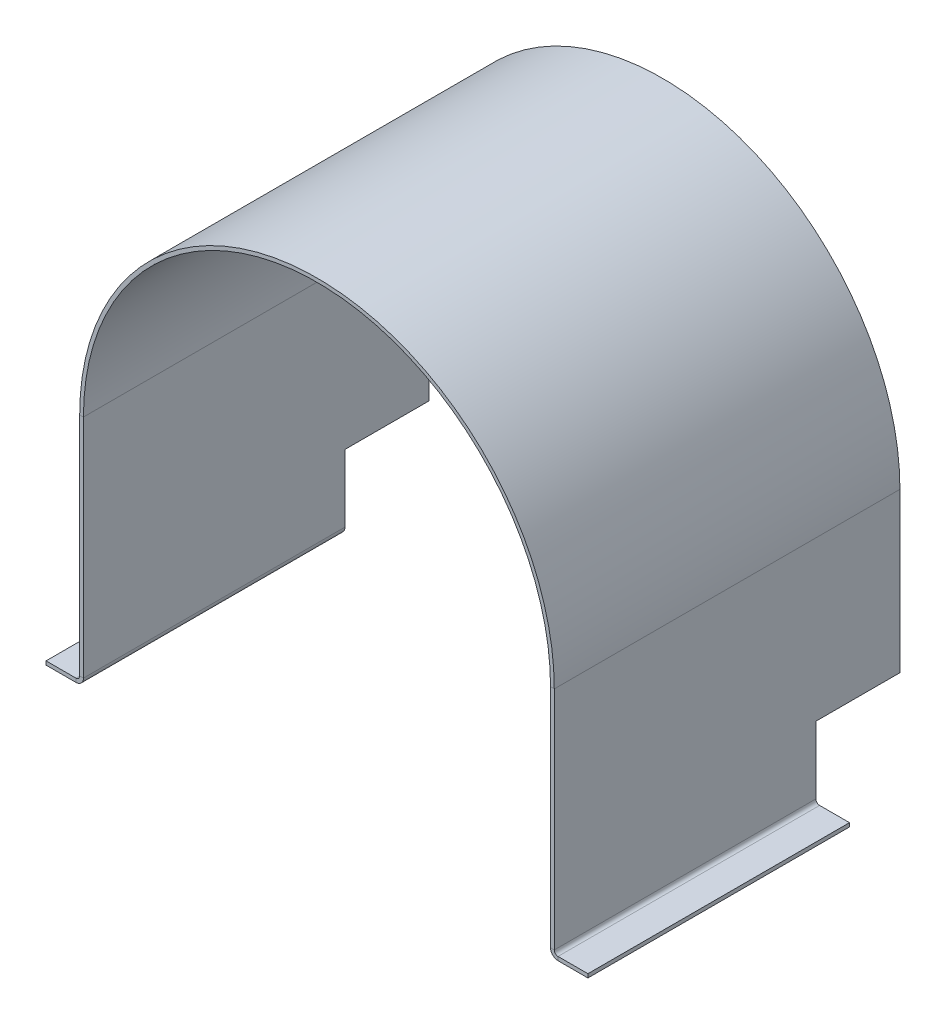
ISO-10303-21;
HEADER;
FILE_DESCRIPTION(('STEP AP214'),'2;1');
FILE_NAME('part.step','',(''),(''),'','','');
FILE_SCHEMA(('AUTOMOTIVE_DESIGN { 1 0 10303 214 1 1 1 1 }'));
ENDSEC;
DATA;
#1=APPLICATION_CONTEXT('core data for automotive mechanical design processes');
#2=APPLICATION_PROTOCOL_DEFINITION('international standard','automotive_design',2000,#1);
#3=PRODUCT_CONTEXT('',#1,'mechanical');
#4=PRODUCT('Part','Part','',(#3));
#5=PRODUCT_RELATED_PRODUCT_CATEGORY('part','',(#4));
#6=PRODUCT_DEFINITION_FORMATION('','',#4);
#7=PRODUCT_DEFINITION_CONTEXT('part definition',#1,'design');
#8=PRODUCT_DEFINITION('design','',#6,#7);
#9=PRODUCT_DEFINITION_SHAPE('','',#8);
#10=(LENGTH_UNIT() NAMED_UNIT(*) SI_UNIT(.MILLI.,.METRE.));
#11=(NAMED_UNIT(*) PLANE_ANGLE_UNIT() SI_UNIT($,.RADIAN.));
#12=(NAMED_UNIT(*) SI_UNIT($,.STERADIAN.) SOLID_ANGLE_UNIT());
#13=UNCERTAINTY_MEASURE_WITH_UNIT(LENGTH_MEASURE(1.E-05),#10,'distance_accuracy_value','');
#14=(GEOMETRIC_REPRESENTATION_CONTEXT(3) GLOBAL_UNCERTAINTY_ASSIGNED_CONTEXT((#13)) GLOBAL_UNIT_ASSIGNED_CONTEXT((#10,
#11,#12)) REPRESENTATION_CONTEXT('',''));
#15=CARTESIAN_POINT('',(0.,0.,0.));
#16=DIRECTION('',(0.,0.,1.));
#17=DIRECTION('',(1.,0.,0.));
#18=AXIS2_PLACEMENT_3D('',#15,#16,#17);
#19=CARTESIAN_POINT('',(-145.,-125.,45.));
#20=DIRECTION('',(0.,0.,1.));
#21=DIRECTION('',(1.,0.,0.));
#22=AXIS2_PLACEMENT_3D('',#19,#20,#21);
#23=PLANE('',#22);
#24=DIRECTION('',(1.,0.,0.));
#25=VECTOR('',#24,1.);
#26=CARTESIAN_POINT('',(-125.,-123.,45.));
#27=LINE('',#26,#25);
#28=CARTESIAN_POINT('',(-145.,-123.,45.));
#29=VERTEX_POINT('',#28);
#30=CARTESIAN_POINT('',(-129.,-123.,45.));
#31=VERTEX_POINT('',#30);
#32=EDGE_CURVE('E252',#29,#31,#27,.T.);
#33=ORIENTED_EDGE('',*,*,#32,.T.);
#34=DIRECTION('',(0.,-1.,0.));
#35=VECTOR('',#34,1.);
#36=CARTESIAN_POINT('',(-129.,-123.,45.));
#37=LINE('',#36,#35);
#38=CARTESIAN_POINT('',(-129.,-125.,45.));
#39=VERTEX_POINT('',#38);
#40=EDGE_CURVE('E11',#31,#39,#37,.T.);
#41=ORIENTED_EDGE('',*,*,#40,.T.);
#42=DIRECTION('',(1.,0.,0.));
#43=VECTOR('',#42,1.);
#44=CARTESIAN_POINT('',(-145.,-125.,45.));
#45=LINE('',#44,#43);
#46=CARTESIAN_POINT('',(-145.,-125.,45.));
#47=VERTEX_POINT('',#46);
#48=EDGE_CURVE('E195',#47,#39,#45,.T.);
#49=ORIENTED_EDGE('',*,*,#48,.F.);
#50=DIRECTION('',(0.,-1.,0.));
#51=VECTOR('',#50,1.);
#52=CARTESIAN_POINT('',(-145.,-125.,45.));
#53=LINE('',#52,#51);
#54=EDGE_CURVE('E184',#29,#47,#53,.T.);
#55=ORIENTED_EDGE('',*,*,#54,.F.);
#56=EDGE_LOOP('',(#33,#41,#49,#55));
#57=FACE_BOUND('',#56,.T.);
#58=ADVANCED_FACE('F38',(#57),#23,.F.);
#59=DIRECTION('',(0.,1.,0.));
#60=VECTOR('',#59,1.);
#61=CARTESIAN_POINT('',(-125.,0.,45.));
#62=LINE('',#61,#60);
#63=CARTESIAN_POINT('',(-125.,-121.,45.));
#64=VERTEX_POINT('',#63);
#65=CARTESIAN_POINT('',(-125.,-84.9999999999999,45.));
#66=VERTEX_POINT('',#65);
#67=EDGE_CURVE('E240',#64,#66,#62,.T.);
#68=ORIENTED_EDGE('',*,*,#67,.F.);
#69=DIRECTION('',(-1.,0.,0.));
#70=VECTOR('',#69,1.);
#71=CARTESIAN_POINT('',(-125.,-121.,45.));
#72=LINE('',#71,#70);
#73=CARTESIAN_POINT('',(-127.,-121.,45.));
#74=VERTEX_POINT('',#73);
#75=EDGE_CURVE('E46',#64,#74,#72,.T.);
#76=ORIENTED_EDGE('',*,*,#75,.T.);
#77=DIRECTION('',(0.,1.,0.));
#78=VECTOR('',#77,1.);
#79=CARTESIAN_POINT('',(-127.,0.,45.));
#80=LINE('',#79,#78);
#81=CARTESIAN_POINT('',(-127.,-84.9999999999999,45.));
#82=VERTEX_POINT('',#81);
#83=EDGE_CURVE('E237',#74,#82,#80,.T.);
#84=ORIENTED_EDGE('',*,*,#83,.T.);
#85=DIRECTION('',(1.,0.,0.));
#86=VECTOR('',#85,1.);
#87=CARTESIAN_POINT('',(-145.,-84.9999999999999,45.));
#88=LINE('',#87,#86);
#89=EDGE_CURVE('E196',#82,#66,#88,.T.);
#90=ORIENTED_EDGE('',*,*,#89,.T.);
#91=EDGE_LOOP('',(#68,#76,#84,#90));
#92=FACE_BOUND('',#91,.T.);
#93=ADVANCED_FACE('F234',(#92),#23,.F.);
#94=DIRECTION('',(0.,-1.,0.));
#95=VECTOR('',#94,1.);
#96=CARTESIAN_POINT('',(127.,0.,45.));
#97=LINE('',#96,#95);
#98=CARTESIAN_POINT('',(127.,-85.,45.));
#99=VERTEX_POINT('',#98);
#100=CARTESIAN_POINT('',(127.,-121.,45.));
#101=VERTEX_POINT('',#100);
#102=EDGE_CURVE('E263',#99,#101,#97,.T.);
#103=ORIENTED_EDGE('',*,*,#102,.T.);
#104=DIRECTION('',(-1.,0.,0.));
#105=VECTOR('',#104,1.);
#106=CARTESIAN_POINT('',(127.,-121.,45.));
#107=LINE('',#106,#105);
#108=CARTESIAN_POINT('',(125.,-121.,45.));
#109=VERTEX_POINT('',#108);
#110=EDGE_CURVE('E230',#101,#109,#107,.T.);
#111=ORIENTED_EDGE('',*,*,#110,.T.);
#112=DIRECTION('',(0.,-1.,0.));
#113=VECTOR('',#112,1.);
#114=CARTESIAN_POINT('',(125.,0.,45.));
#115=LINE('',#114,#113);
#116=CARTESIAN_POINT('',(125.,-85.,45.));
#117=VERTEX_POINT('',#116);
#118=EDGE_CURVE('E435',#117,#109,#115,.T.);
#119=ORIENTED_EDGE('',*,*,#118,.F.);
#120=EDGE_CURVE('E426',#117,#99,#88,.T.);
#121=ORIENTED_EDGE('',*,*,#120,.T.);
#122=EDGE_LOOP('',(#103,#111,#119,#121));
#123=FACE_BOUND('',#122,.T.);
#124=ADVANCED_FACE('F433',(#123),#23,.F.);
#125=CARTESIAN_POINT('',(129.,-125.,45.));
#126=VERTEX_POINT('',#125);
#127=CARTESIAN_POINT('',(145.,-125.,45.));
#128=VERTEX_POINT('',#127);
#129=EDGE_CURVE('E177',#126,#128,#45,.T.);
#130=ORIENTED_EDGE('',*,*,#129,.F.);
#131=DIRECTION('',(0.,1.,0.));
#132=VECTOR('',#131,1.);
#133=CARTESIAN_POINT('',(129.,-125.,45.));
#134=LINE('',#133,#132);
#135=CARTESIAN_POINT('',(129.,-123.,45.));
#136=VERTEX_POINT('',#135);
#137=EDGE_CURVE('E61',#126,#136,#134,.T.);
#138=ORIENTED_EDGE('',*,*,#137,.T.);
#139=DIRECTION('',(1.,0.,0.));
#140=VECTOR('',#139,1.);
#141=CARTESIAN_POINT('',(125.,-123.,45.));
#142=LINE('',#141,#140);
#143=CARTESIAN_POINT('',(145.,-123.,45.));
#144=VERTEX_POINT('',#143);
#145=EDGE_CURVE('E180',#136,#144,#142,.T.);
#146=ORIENTED_EDGE('',*,*,#145,.T.);
#147=DIRECTION('',(0.,-1.,0.));
#148=VECTOR('',#147,1.);
#149=CARTESIAN_POINT('',(145.,-125.,45.));
#150=LINE('',#149,#148);
#151=EDGE_CURVE('E174',#144,#128,#150,.T.);
#152=ORIENTED_EDGE('',*,*,#151,.T.);
#153=EDGE_LOOP('',(#130,#138,#146,#152));
#154=FACE_BOUND('',#153,.T.);
#155=ADVANCED_FACE('F176',(#154),#23,.F.);
#156=CARTESIAN_POINT('',(-125.,0.,185.));
#157=DIRECTION('',(0.,0.,1.));
#158=DIRECTION('',(1.,0.,0.));
#159=AXIS2_PLACEMENT_3D('',#156,#157,#158);
#160=PLANE('',#159);
#161=DIRECTION('',(-1.,0.,0.));
#162=VECTOR('',#161,1.);
#163=CARTESIAN_POINT('',(-125.,0.,185.));
#164=LINE('',#163,#162);
#165=CARTESIAN_POINT('',(-125.,0.,185.));
#166=VERTEX_POINT('',#165);
#167=CARTESIAN_POINT('',(-127.,0.,185.));
#168=VERTEX_POINT('',#167);
#169=EDGE_CURVE('E222',#166,#168,#164,.T.);
#170=ORIENTED_EDGE('',*,*,#169,.F.);
#171=CARTESIAN_POINT('',(0.,0.,185.));
#172=DIRECTION('',(0.,0.,-1.));
#173=DIRECTION('',(-1.,0.,0.));
#174=AXIS2_PLACEMENT_3D('',#171,#172,#173);
#175=CIRCLE('',#174,125.);
#176=CARTESIAN_POINT('',(125.,0.,185.));
#177=VERTEX_POINT('',#176);
#178=EDGE_CURVE('E331',#166,#177,#175,.T.);
#179=ORIENTED_EDGE('',*,*,#178,.T.);
#180=DIRECTION('',(-1.,0.,0.));
#181=VECTOR('',#180,1.);
#182=CARTESIAN_POINT('',(127.,0.,185.));
#183=LINE('',#182,#181);
#184=CARTESIAN_POINT('',(127.,0.,185.));
#185=VERTEX_POINT('',#184);
#186=EDGE_CURVE('E220',#185,#177,#183,.T.);
#187=ORIENTED_EDGE('',*,*,#186,.F.);
#188=CARTESIAN_POINT('',(0.,0.,185.));
#189=DIRECTION('',(0.,0.,1.));
#190=DIRECTION('',(1.,0.,0.));
#191=AXIS2_PLACEMENT_3D('',#188,#189,#190);
#192=CIRCLE('',#191,127.);
#193=EDGE_CURVE('E310',#168,#185,#192,.F.);
#194=ORIENTED_EDGE('',*,*,#193,.F.);
#195=EDGE_LOOP('',(#170,#179,#187,#194));
#196=FACE_BOUND('',#195,.T.);
#197=ADVANCED_FACE('F40',(#196),#160,.T.);
#198=CARTESIAN_POINT('',(127.,0.,185.));
#199=DIRECTION('',(0.,0.,1.));
#200=DIRECTION('',(1.,0.,0.));
#201=AXIS2_PLACEMENT_3D('',#198,#199,#200);
#202=PLANE('',#201);
#203=DIRECTION('',(0.,1.,0.));
#204=VECTOR('',#203,1.);
#205=CARTESIAN_POINT('',(-125.,0.,185.));
#206=LINE('',#205,#204);
#207=CARTESIAN_POINT('',(-125.,-121.,185.));
#208=VERTEX_POINT('',#207);
#209=EDGE_CURVE('E328',#208,#166,#206,.T.);
#210=ORIENTED_EDGE('',*,*,#209,.T.);
#211=ORIENTED_EDGE('',*,*,#169,.T.);
#212=DIRECTION('',(0.,1.,0.));
#213=VECTOR('',#212,1.);
#214=CARTESIAN_POINT('',(-127.,0.,185.));
#215=LINE('',#214,#213);
#216=CARTESIAN_POINT('',(-127.,-121.,185.));
#217=VERTEX_POINT('',#216);
#218=EDGE_CURVE('E313',#217,#168,#215,.T.);
#219=ORIENTED_EDGE('',*,*,#218,.F.);
#220=DIRECTION('',(1.,0.,0.));
#221=VECTOR('',#220,1.);
#222=CARTESIAN_POINT('',(-127.,-121.,185.));
#223=LINE('',#222,#221);
#224=EDGE_CURVE('E211',#217,#208,#223,.T.);
#225=ORIENTED_EDGE('',*,*,#224,.T.);
#226=EDGE_LOOP('',(#210,#211,#219,#225));
#227=FACE_BOUND('',#226,.T.);
#228=ADVANCED_FACE('F392',(#227),#202,.T.);
#229=CARTESIAN_POINT('',(125.,0.,0.));
#230=DIRECTION('',(0.,0.,-1.));
#231=DIRECTION('',(-1.,0.,0.));
#232=AXIS2_PLACEMENT_3D('',#229,#230,#231);
#233=PLANE('',#232);
#234=DIRECTION('',(1.,0.,0.));
#235=VECTOR('',#234,1.);
#236=CARTESIAN_POINT('',(125.,0.,0.));
#237=LINE('',#236,#235);
#238=CARTESIAN_POINT('',(125.,0.,0.));
#239=VERTEX_POINT('',#238);
#240=CARTESIAN_POINT('',(127.,0.,0.));
#241=VERTEX_POINT('',#240);
#242=EDGE_CURVE('E218',#239,#241,#237,.T.);
#243=ORIENTED_EDGE('',*,*,#242,.F.);
#244=CARTESIAN_POINT('',(0.,0.,0.));
#245=DIRECTION('',(0.,0.,-1.));
#246=DIRECTION('',(-1.,0.,0.));
#247=AXIS2_PLACEMENT_3D('',#244,#245,#246);
#248=CIRCLE('',#247,125.);
#249=CARTESIAN_POINT('',(-125.,0.,0.));
#250=VERTEX_POINT('',#249);
#251=EDGE_CURVE('E350',#250,#239,#248,.T.);
#252=ORIENTED_EDGE('',*,*,#251,.F.);
#253=DIRECTION('',(1.,0.,0.));
#254=VECTOR('',#253,1.);
#255=CARTESIAN_POINT('',(-127.,0.,0.));
#256=LINE('',#255,#254);
#257=CARTESIAN_POINT('',(-127.,0.,0.));
#258=VERTEX_POINT('',#257);
#259=EDGE_CURVE('E215',#258,#250,#256,.T.);
#260=ORIENTED_EDGE('',*,*,#259,.F.);
#261=CARTESIAN_POINT('',(0.,0.,0.));
#262=DIRECTION('',(0.,0.,1.));
#263=DIRECTION('',(1.,0.,0.));
#264=AXIS2_PLACEMENT_3D('',#261,#262,#263);
#265=CIRCLE('',#264,127.);
#266=EDGE_CURVE('E342',#258,#241,#265,.F.);
#267=ORIENTED_EDGE('',*,*,#266,.T.);
#268=EDGE_LOOP('',(#243,#252,#260,#267));
#269=FACE_BOUND('',#268,.T.);
#270=ADVANCED_FACE('F404',(#269),#233,.T.);
#271=CARTESIAN_POINT('',(-127.,0.,0.));
#272=DIRECTION('',(0.,0.,-1.));
#273=DIRECTION('',(-1.,0.,0.));
#274=AXIS2_PLACEMENT_3D('',#271,#272,#273);
#275=PLANE('',#274);
#276=DIRECTION('',(1.,0.,0.));
#277=VECTOR('',#276,1.);
#278=CARTESIAN_POINT('',(-145.,-84.9999999999999,0.));
#279=LINE('',#278,#277);
#280=CARTESIAN_POINT('',(125.,-85.,0.));
#281=VERTEX_POINT('',#280);
#282=CARTESIAN_POINT('',(127.,-85.,0.));
#283=VERTEX_POINT('',#282);
#284=EDGE_CURVE('E428',#281,#283,#279,.T.);
#285=ORIENTED_EDGE('',*,*,#284,.F.);
#286=DIRECTION('',(0.,-1.,0.));
#287=VECTOR('',#286,1.);
#288=CARTESIAN_POINT('',(125.,0.,0.));
#289=LINE('',#288,#287);
#290=EDGE_CURVE('E353',#239,#281,#289,.T.);
#291=ORIENTED_EDGE('',*,*,#290,.F.);
#292=ORIENTED_EDGE('',*,*,#242,.T.);
#293=DIRECTION('',(0.,-1.,0.));
#294=VECTOR('',#293,1.);
#295=CARTESIAN_POINT('',(127.,0.,0.));
#296=LINE('',#295,#294);
#297=EDGE_CURVE('E339',#241,#283,#296,.T.);
#298=ORIENTED_EDGE('',*,*,#297,.T.);
#299=EDGE_LOOP('',(#285,#291,#292,#298));
#300=FACE_BOUND('',#299,.T.);
#301=ADVANCED_FACE('F576',(#300),#275,.T.);
#302=CARTESIAN_POINT('',(-129.,-125.,185.));
#303=DIRECTION('',(0.,0.,1.));
#304=DIRECTION('',(1.,0.,0.));
#305=AXIS2_PLACEMENT_3D('',#302,#303,#304);
#306=PLANE('',#305);
#307=DIRECTION('',(0.,1.,0.));
#308=VECTOR('',#307,1.);
#309=CARTESIAN_POINT('',(-129.,-125.,185.));
#310=LINE('',#309,#308);
#311=CARTESIAN_POINT('',(-129.,-125.,185.));
#312=VERTEX_POINT('',#311);
#313=CARTESIAN_POINT('',(-129.,-123.,185.));
#314=VERTEX_POINT('',#313);
#315=EDGE_CURVE('E213',#312,#314,#310,.T.);
#316=ORIENTED_EDGE('',*,*,#315,.F.);
#317=CARTESIAN_POINT('',(-129.,-121.,185.));
#318=DIRECTION('',(0.,0.,-1.));
#319=DIRECTION('',(-1.,0.,0.));
#320=AXIS2_PLACEMENT_3D('',#317,#318,#319);
#321=CIRCLE('',#320,4.);
#322=EDGE_CURVE('E325',#312,#208,#321,.F.);
#323=ORIENTED_EDGE('',*,*,#322,.T.);
#324=ORIENTED_EDGE('',*,*,#224,.F.);
#325=CARTESIAN_POINT('',(-129.,-121.,185.));
#326=DIRECTION('',(0.,0.,1.));
#327=DIRECTION('',(1.,0.,0.));
#328=AXIS2_PLACEMENT_3D('',#325,#326,#327);
#329=CIRCLE('',#328,2.);
#330=EDGE_CURVE('E268',#314,#217,#329,.T.);
#331=ORIENTED_EDGE('',*,*,#330,.F.);
#332=EDGE_LOOP('',(#316,#323,#324,#331));
#333=FACE_BOUND('',#332,.T.);
#334=ADVANCED_FACE('F388',(#333),#306,.T.);
#335=CARTESIAN_POINT('',(-127.,-121.,185.));
#336=DIRECTION('',(0.,0.,1.));
#337=DIRECTION('',(1.,0.,0.));
#338=AXIS2_PLACEMENT_3D('',#335,#336,#337);
#339=PLANE('',#338);
#340=DIRECTION('',(1.,0.,0.));
#341=VECTOR('',#340,1.);
#342=CARTESIAN_POINT('',(-125.,-125.,185.));
#343=LINE('',#342,#341);
#344=CARTESIAN_POINT('',(-145.,-125.,185.));
#345=VERTEX_POINT('',#344);
#346=EDGE_CURVE('E322',#345,#312,#343,.T.);
#347=ORIENTED_EDGE('',*,*,#346,.T.);
#348=ORIENTED_EDGE('',*,*,#315,.T.);
#349=DIRECTION('',(1.,0.,0.));
#350=VECTOR('',#349,1.);
#351=CARTESIAN_POINT('',(-125.,-123.,185.));
#352=LINE('',#351,#350);
#353=CARTESIAN_POINT('',(-145.,-123.,185.));
#354=VERTEX_POINT('',#353);
#355=EDGE_CURVE('E316',#354,#314,#352,.T.);
#356=ORIENTED_EDGE('',*,*,#355,.F.);
#357=DIRECTION('',(0.,1.,0.));
#358=VECTOR('',#357,1.);
#359=CARTESIAN_POINT('',(-145.,-125.,185.));
#360=LINE('',#359,#358);
#361=EDGE_CURVE('E319',#345,#354,#360,.T.);
#362=ORIENTED_EDGE('',*,*,#361,.F.);
#363=EDGE_LOOP('',(#347,#348,#356,#362));
#364=FACE_BOUND('',#363,.T.);
#365=ADVANCED_FACE('F384',(#364),#339,.T.);
#366=CARTESIAN_POINT('',(-129.,-123.,0.));
#367=DIRECTION('',(0.,0.,-1.));
#368=DIRECTION('',(-1.,0.,0.));
#369=AXIS2_PLACEMENT_3D('',#366,#367,#368);
#370=PLANE('',#369);
#371=CARTESIAN_POINT('',(-127.,-84.9999999999999,0.));
#372=VERTEX_POINT('',#371);
#373=CARTESIAN_POINT('',(-125.,-84.9999999999999,0.));
#374=VERTEX_POINT('',#373);
#375=EDGE_CURVE('E53',#372,#374,#279,.T.);
#376=ORIENTED_EDGE('',*,*,#375,.F.);
#377=DIRECTION('',(0.,1.,0.));
#378=VECTOR('',#377,1.);
#379=CARTESIAN_POINT('',(-127.,0.,0.));
#380=LINE('',#379,#378);
#381=EDGE_CURVE('E346',#372,#258,#380,.T.);
#382=ORIENTED_EDGE('',*,*,#381,.T.);
#383=ORIENTED_EDGE('',*,*,#259,.T.);
#384=DIRECTION('',(0.,1.,0.));
#385=VECTOR('',#384,1.);
#386=CARTESIAN_POINT('',(-125.,0.,0.));
#387=LINE('',#386,#385);
#388=EDGE_CURVE('E348',#374,#250,#387,.T.);
#389=ORIENTED_EDGE('',*,*,#388,.F.);
#390=EDGE_LOOP('',(#376,#382,#383,#389));
#391=FACE_BOUND('',#390,.T.);
#392=ADVANCED_FACE('F408',(#391),#370,.T.);
#393=CARTESIAN_POINT('',(125.,-121.,185.));
#394=DIRECTION('',(0.,0.,1.));
#395=DIRECTION('',(1.,0.,0.));
#396=AXIS2_PLACEMENT_3D('',#393,#394,#395);
#397=PLANE('',#396);
#398=DIRECTION('',(1.,0.,0.));
#399=VECTOR('',#398,1.);
#400=CARTESIAN_POINT('',(125.,-121.,185.));
#401=LINE('',#400,#399);
#402=CARTESIAN_POINT('',(125.,-121.,185.));
#403=VERTEX_POINT('',#402);
#404=CARTESIAN_POINT('',(127.,-121.,185.));
#405=VERTEX_POINT('',#404);
#406=EDGE_CURVE('E204',#403,#405,#401,.T.);
#407=ORIENTED_EDGE('',*,*,#406,.F.);
#408=CARTESIAN_POINT('',(129.,-121.,185.));
#409=DIRECTION('',(0.,0.,-1.));
#410=DIRECTION('',(-1.,0.,0.));
#411=AXIS2_PLACEMENT_3D('',#408,#409,#410);
#412=CIRCLE('',#411,4.);
#413=CARTESIAN_POINT('',(129.,-125.,185.));
#414=VERTEX_POINT('',#413);
#415=EDGE_CURVE('E337',#403,#414,#412,.F.);
#416=ORIENTED_EDGE('',*,*,#415,.T.);
#417=DIRECTION('',(0.,-1.,0.));
#418=VECTOR('',#417,1.);
#419=CARTESIAN_POINT('',(129.,-123.,185.));
#420=LINE('',#419,#418);
#421=CARTESIAN_POINT('',(129.,-123.,185.));
#422=VERTEX_POINT('',#421);
#423=EDGE_CURVE('E201',#422,#414,#420,.T.);
#424=ORIENTED_EDGE('',*,*,#423,.F.);
#425=CARTESIAN_POINT('',(129.,-121.,185.));
#426=DIRECTION('',(0.,0.,1.));
#427=DIRECTION('',(1.,0.,0.));
#428=AXIS2_PLACEMENT_3D('',#425,#426,#427);
#429=CIRCLE('',#428,2.);
#430=EDGE_CURVE('E292',#405,#422,#429,.T.);
#431=ORIENTED_EDGE('',*,*,#430,.F.);
#432=EDGE_LOOP('',(#407,#416,#424,#431));
#433=FACE_BOUND('',#432,.T.);
#434=ADVANCED_FACE('F542',(#433),#397,.T.);
#435=CARTESIAN_POINT('',(129.,-123.,185.));
#436=DIRECTION('',(0.,0.,1.));
#437=DIRECTION('',(1.,0.,0.));
#438=AXIS2_PLACEMENT_3D('',#435,#436,#437);
#439=PLANE('',#438);
#440=DIRECTION('',(0.,-1.,0.));
#441=VECTOR('',#440,1.);
#442=CARTESIAN_POINT('',(125.,0.,185.));
#443=LINE('',#442,#441);
#444=EDGE_CURVE('E334',#177,#403,#443,.T.);
#445=ORIENTED_EDGE('',*,*,#444,.T.);
#446=ORIENTED_EDGE('',*,*,#406,.T.);
#447=DIRECTION('',(0.,-1.,0.));
#448=VECTOR('',#447,1.);
#449=CARTESIAN_POINT('',(127.,0.,185.));
#450=LINE('',#449,#448);
#451=EDGE_CURVE('E302',#185,#405,#450,.T.);
#452=ORIENTED_EDGE('',*,*,#451,.F.);
#453=ORIENTED_EDGE('',*,*,#186,.T.);
#454=EDGE_LOOP('',(#445,#446,#452,#453));
#455=FACE_BOUND('',#454,.T.);
#456=ADVANCED_FACE('F537',(#455),#439,.T.);
#457=CARTESIAN_POINT('',(125.,-125.,185.));
#458=DIRECTION('',(0.,1.,0.));
#459=DIRECTION('',(-1.,0.,0.));
#460=AXIS2_PLACEMENT_3D('',#457,#458,#459);
#461=PLANE('',#460);
#462=DIRECTION('',(0.,0.,-1.));
#463=VECTOR('',#462,1.);
#464=CARTESIAN_POINT('',(129.,-125.,185.));
#465=LINE('',#464,#463);
#466=EDGE_CURVE('E194',#414,#126,#465,.T.);
#467=ORIENTED_EDGE('',*,*,#466,.T.);
#468=ORIENTED_EDGE('',*,*,#129,.T.);
#469=DIRECTION('',(0.,0.,-1.));
#470=VECTOR('',#469,1.);
#471=CARTESIAN_POINT('',(145.,-125.,185.));
#472=LINE('',#471,#470);
#473=CARTESIAN_POINT('',(145.,-125.,185.));
#474=VERTEX_POINT('',#473);
#475=EDGE_CURVE('E191',#474,#128,#472,.T.);
#476=ORIENTED_EDGE('',*,*,#475,.F.);
#477=DIRECTION('',(1.,0.,0.));
#478=VECTOR('',#477,1.);
#479=CARTESIAN_POINT('',(125.,-125.,185.));
#480=LINE('',#479,#478);
#481=EDGE_CURVE('E304',#414,#474,#480,.T.);
#482=ORIENTED_EDGE('',*,*,#481,.F.);
#483=EDGE_LOOP('',(#467,#468,#476,#482));
#484=FACE_BOUND('',#483,.T.);
#485=ADVANCED_FACE('F189',(#484),#461,.F.);
#486=CARTESIAN_POINT('',(145.,-123.,185.));
#487=DIRECTION('',(1.,0.,0.));
#488=DIRECTION('',(0.,0.,-1.));
#489=AXIS2_PLACEMENT_3D('',#486,#487,#488);
#490=PLANE('',#489);
#491=ORIENTED_EDGE('',*,*,#151,.F.);
#492=DIRECTION('',(0.,0.,-1.));
#493=VECTOR('',#492,1.);
#494=CARTESIAN_POINT('',(145.,-123.,185.));
#495=LINE('',#494,#493);
#496=CARTESIAN_POINT('',(145.,-123.,185.));
#497=VERTEX_POINT('',#496);
#498=EDGE_CURVE('E202',#497,#144,#495,.T.);
#499=ORIENTED_EDGE('',*,*,#498,.F.);
#500=DIRECTION('',(0.,-1.,0.));
#501=VECTOR('',#500,1.);
#502=CARTESIAN_POINT('',(145.,-123.,185.));
#503=LINE('',#502,#501);
#504=EDGE_CURVE('E200',#497,#474,#503,.T.);
#505=ORIENTED_EDGE('',*,*,#504,.T.);
#506=ORIENTED_EDGE('',*,*,#475,.T.);
#507=EDGE_LOOP('',(#491,#499,#505,#506));
#508=FACE_BOUND('',#507,.T.);
#509=ADVANCED_FACE('F198',(#508),#490,.T.);
#510=CARTESIAN_POINT('',(125.,-123.,185.));
#511=DIRECTION('',(0.,1.,0.));
#512=DIRECTION('',(-1.,0.,0.));
#513=AXIS2_PLACEMENT_3D('',#510,#511,#512);
#514=PLANE('',#513);
#515=ORIENTED_EDGE('',*,*,#145,.F.);
#516=DIRECTION('',(0.,0.,-1.));
#517=VECTOR('',#516,1.);
#518=CARTESIAN_POINT('',(129.,-123.,185.));
#519=LINE('',#518,#517);
#520=EDGE_CURVE('E206',#422,#136,#519,.T.);
#521=ORIENTED_EDGE('',*,*,#520,.F.);
#522=DIRECTION('',(1.,0.,0.));
#523=VECTOR('',#522,1.);
#524=CARTESIAN_POINT('',(125.,-123.,185.));
#525=LINE('',#524,#523);
#526=EDGE_CURVE('E297',#422,#497,#525,.T.);
#527=ORIENTED_EDGE('',*,*,#526,.T.);
#528=ORIENTED_EDGE('',*,*,#498,.T.);
#529=EDGE_LOOP('',(#515,#521,#527,#528));
#530=FACE_BOUND('',#529,.T.);
#531=ADVANCED_FACE('F296',(#530),#514,.T.);
#532=CARTESIAN_POINT('',(129.,-121.,185.));
#533=DIRECTION('',(0.,0.,-1.));
#534=DIRECTION('',(-1.,0.,0.));
#535=AXIS2_PLACEMENT_3D('',#532,#533,#534);
#536=CYLINDRICAL_SURFACE('',#535,2.);
#537=CARTESIAN_POINT('',(129.,-121.,45.));
#538=DIRECTION('',(0.,0.,1.));
#539=DIRECTION('',(1.,0.,0.));
#540=AXIS2_PLACEMENT_3D('',#537,#538,#539);
#541=CIRCLE('',#540,2.);
#542=EDGE_CURVE('E290',#101,#136,#541,.T.);
#543=ORIENTED_EDGE('',*,*,#542,.F.);
#544=DIRECTION('',(0.,0.,-1.));
#545=VECTOR('',#544,1.);
#546=CARTESIAN_POINT('',(127.,-121.,185.));
#547=LINE('',#546,#545);
#548=EDGE_CURVE('E281',#405,#101,#547,.T.);
#549=ORIENTED_EDGE('',*,*,#548,.F.);
#550=ORIENTED_EDGE('',*,*,#430,.T.);
#551=ORIENTED_EDGE('',*,*,#520,.T.);
#552=EDGE_LOOP('',(#543,#549,#550,#551));
#553=FACE_BOUND('',#552,.T.);
#554=ADVANCED_FACE('F288',(#553),#536,.F.);
#555=CARTESIAN_POINT('',(127.,0.,185.));
#556=DIRECTION('',(1.,0.,0.));
#557=DIRECTION('',(0.,1.,0.));
#558=AXIS2_PLACEMENT_3D('',#555,#556,#557);
#559=PLANE('',#558);
#560=ORIENTED_EDGE('',*,*,#102,.F.);
#561=DIRECTION('',(0.,0.,1.));
#562=VECTOR('',#561,1.);
#563=CARTESIAN_POINT('',(127.,-85.,185.));
#564=LINE('',#563,#562);
#565=EDGE_CURVE('E343',#283,#99,#564,.T.);
#566=ORIENTED_EDGE('',*,*,#565,.F.);
#567=ORIENTED_EDGE('',*,*,#297,.F.);
#568=DIRECTION('',(0.,0.,-1.));
#569=VECTOR('',#568,1.);
#570=CARTESIAN_POINT('',(127.,0.,185.));
#571=LINE('',#570,#569);
#572=EDGE_CURVE('E273',#185,#241,#571,.T.);
#573=ORIENTED_EDGE('',*,*,#572,.F.);
#574=ORIENTED_EDGE('',*,*,#451,.T.);
#575=ORIENTED_EDGE('',*,*,#548,.T.);
#576=EDGE_LOOP('',(#560,#566,#567,#573,#574,#575));
#577=FACE_BOUND('',#576,.T.);
#578=ADVANCED_FACE('F437',(#577),#559,.T.);
#579=CARTESIAN_POINT('',(0.,0.,185.));
#580=DIRECTION('',(0.,0.,-1.));
#581=DIRECTION('',(-1.,0.,0.));
#582=AXIS2_PLACEMENT_3D('',#579,#580,#581);
#583=CYLINDRICAL_SURFACE('',#582,127.);
#584=ORIENTED_EDGE('',*,*,#266,.F.);
#585=DIRECTION('',(0.,0.,-1.));
#586=VECTOR('',#585,1.);
#587=CARTESIAN_POINT('',(-127.,0.,185.));
#588=LINE('',#587,#586);
#589=EDGE_CURVE('E269',#168,#258,#588,.T.);
#590=ORIENTED_EDGE('',*,*,#589,.F.);
#591=ORIENTED_EDGE('',*,*,#193,.T.);
#592=ORIENTED_EDGE('',*,*,#572,.T.);
#593=EDGE_LOOP('',(#584,#590,#591,#592));
#594=FACE_BOUND('',#593,.T.);
#595=ADVANCED_FACE('F399',(#594),#583,.T.);
#596=CARTESIAN_POINT('',(-127.,0.,185.));
#597=DIRECTION('',(-1.,0.,0.));
#598=DIRECTION('',(0.,-1.,0.));
#599=AXIS2_PLACEMENT_3D('',#596,#597,#598);
#600=PLANE('',#599);
#601=ORIENTED_EDGE('',*,*,#83,.F.);
#602=DIRECTION('',(0.,0.,-1.));
#603=VECTOR('',#602,1.);
#604=CARTESIAN_POINT('',(-127.,-121.,185.));
#605=LINE('',#604,#603);
#606=EDGE_CURVE('E259',#217,#74,#605,.T.);
#607=ORIENTED_EDGE('',*,*,#606,.F.);
#608=ORIENTED_EDGE('',*,*,#218,.T.);
#609=ORIENTED_EDGE('',*,*,#589,.T.);
#610=ORIENTED_EDGE('',*,*,#381,.F.);
#611=DIRECTION('',(0.,0.,-1.));
#612=VECTOR('',#611,1.);
#613=CARTESIAN_POINT('',(-127.,-84.9999999999999,185.));
#614=LINE('',#613,#612);
#615=EDGE_CURVE('E262',#82,#372,#614,.T.);
#616=ORIENTED_EDGE('',*,*,#615,.F.);
#617=EDGE_LOOP('',(#601,#607,#608,#609,#610,#616));
#618=FACE_BOUND('',#617,.T.);
#619=ADVANCED_FACE('F257',(#618),#600,.T.);
#620=CARTESIAN_POINT('',(-129.,-121.,185.));
#621=DIRECTION('',(0.,0.,-1.));
#622=DIRECTION('',(-1.,0.,0.));
#623=AXIS2_PLACEMENT_3D('',#620,#621,#622);
#624=CYLINDRICAL_SURFACE('',#623,2.);
#625=CARTESIAN_POINT('',(-129.,-121.,45.));
#626=DIRECTION('',(0.,0.,1.));
#627=DIRECTION('',(1.,0.,0.));
#628=AXIS2_PLACEMENT_3D('',#625,#626,#627);
#629=CIRCLE('',#628,2.);
#630=EDGE_CURVE('E245',#31,#74,#629,.T.);
#631=ORIENTED_EDGE('',*,*,#630,.F.);
#632=DIRECTION('',(0.,0.,-1.));
#633=VECTOR('',#632,1.);
#634=CARTESIAN_POINT('',(-129.,-123.,185.));
#635=LINE('',#634,#633);
#636=EDGE_CURVE('E270',#314,#31,#635,.T.);
#637=ORIENTED_EDGE('',*,*,#636,.F.);
#638=ORIENTED_EDGE('',*,*,#330,.T.);
#639=ORIENTED_EDGE('',*,*,#606,.T.);
#640=EDGE_LOOP('',(#631,#637,#638,#639));
#641=FACE_BOUND('',#640,.T.);
#642=ADVANCED_FACE('F266',(#641),#624,.F.);
#643=CARTESIAN_POINT('',(-125.,-123.,185.));
#644=DIRECTION('',(0.,1.,0.));
#645=DIRECTION('',(-1.,0.,0.));
#646=AXIS2_PLACEMENT_3D('',#643,#644,#645);
#647=PLANE('',#646);
#648=ORIENTED_EDGE('',*,*,#32,.F.);
#649=DIRECTION('',(0.,0.,-1.));
#650=VECTOR('',#649,1.);
#651=CARTESIAN_POINT('',(-145.,-123.,185.));
#652=LINE('',#651,#650);
#653=EDGE_CURVE('E275',#354,#29,#652,.T.);
#654=ORIENTED_EDGE('',*,*,#653,.F.);
#655=ORIENTED_EDGE('',*,*,#355,.T.);
#656=ORIENTED_EDGE('',*,*,#636,.T.);
#657=EDGE_LOOP('',(#648,#654,#655,#656));
#658=FACE_BOUND('',#657,.T.);
#659=ADVANCED_FACE('F382',(#658),#647,.T.);
#660=CARTESIAN_POINT('',(-145.,-125.,185.));
#661=DIRECTION('',(-1.,0.,0.));
#662=DIRECTION('',(0.,0.,1.));
#663=AXIS2_PLACEMENT_3D('',#660,#661,#662);
#664=PLANE('',#663);
#665=ORIENTED_EDGE('',*,*,#54,.T.);
#666=DIRECTION('',(0.,0.,-1.));
#667=VECTOR('',#666,1.);
#668=CARTESIAN_POINT('',(-145.,-125.,185.));
#669=LINE('',#668,#667);
#670=EDGE_CURVE('E372',#345,#47,#669,.T.);
#671=ORIENTED_EDGE('',*,*,#670,.F.);
#672=ORIENTED_EDGE('',*,*,#361,.T.);
#673=ORIENTED_EDGE('',*,*,#653,.T.);
#674=EDGE_LOOP('',(#665,#671,#672,#673));
#675=FACE_BOUND('',#674,.T.);
#676=ADVANCED_FACE('F377',(#675),#664,.T.);
#677=CARTESIAN_POINT('',(-125.,-125.,185.));
#678=DIRECTION('',(0.,1.,0.));
#679=DIRECTION('',(-1.,0.,0.));
#680=AXIS2_PLACEMENT_3D('',#677,#678,#679);
#681=PLANE('',#680);
#682=ORIENTED_EDGE('',*,*,#670,.T.);
#683=ORIENTED_EDGE('',*,*,#48,.T.);
#684=DIRECTION('',(0.,0.,-1.));
#685=VECTOR('',#684,1.);
#686=CARTESIAN_POINT('',(-129.,-125.,185.));
#687=LINE('',#686,#685);
#688=EDGE_CURVE('E369',#312,#39,#687,.T.);
#689=ORIENTED_EDGE('',*,*,#688,.F.);
#690=ORIENTED_EDGE('',*,*,#346,.F.);
#691=EDGE_LOOP('',(#682,#683,#689,#690));
#692=FACE_BOUND('',#691,.T.);
#693=ADVANCED_FACE('F448',(#692),#681,.F.);
#694=CARTESIAN_POINT('',(-129.,-121.,185.));
#695=DIRECTION('',(0.,0.,-1.));
#696=DIRECTION('',(-1.,0.,0.));
#697=AXIS2_PLACEMENT_3D('',#694,#695,#696);
#698=CYLINDRICAL_SURFACE('',#697,4.);
#699=ORIENTED_EDGE('',*,*,#688,.T.);
#700=CARTESIAN_POINT('',(-129.,-121.,45.));
#701=DIRECTION('',(0.,0.,1.));
#702=DIRECTION('',(1.,0.,0.));
#703=AXIS2_PLACEMENT_3D('',#700,#701,#702);
#704=CIRCLE('',#703,4.);
#705=EDGE_CURVE('E441',#39,#64,#704,.T.);
#706=ORIENTED_EDGE('',*,*,#705,.T.);
#707=DIRECTION('',(0.,0.,-1.));
#708=VECTOR('',#707,1.);
#709=CARTESIAN_POINT('',(-125.,-121.,185.));
#710=LINE('',#709,#708);
#711=EDGE_CURVE('E366',#208,#64,#710,.T.);
#712=ORIENTED_EDGE('',*,*,#711,.F.);
#713=ORIENTED_EDGE('',*,*,#322,.F.);
#714=EDGE_LOOP('',(#699,#706,#712,#713));
#715=FACE_BOUND('',#714,.T.);
#716=ADVANCED_FACE('F451',(#715),#698,.T.);
#717=CARTESIAN_POINT('',(-125.,0.,185.));
#718=DIRECTION('',(-1.,0.,0.));
#719=DIRECTION('',(0.,-1.,0.));
#720=AXIS2_PLACEMENT_3D('',#717,#718,#719);
#721=PLANE('',#720);
#722=ORIENTED_EDGE('',*,*,#711,.T.);
#723=ORIENTED_EDGE('',*,*,#67,.T.);
#724=DIRECTION('',(0.,0.,-1.));
#725=VECTOR('',#724,1.);
#726=CARTESIAN_POINT('',(-125.,-84.9999999999999,185.));
#727=LINE('',#726,#725);
#728=EDGE_CURVE('E415',#66,#374,#727,.T.);
#729=ORIENTED_EDGE('',*,*,#728,.T.);
#730=ORIENTED_EDGE('',*,*,#388,.T.);
#731=DIRECTION('',(0.,0.,-1.));
#732=VECTOR('',#731,1.);
#733=CARTESIAN_POINT('',(-125.,0.,185.));
#734=LINE('',#733,#732);
#735=EDGE_CURVE('E363',#166,#250,#734,.T.);
#736=ORIENTED_EDGE('',*,*,#735,.F.);
#737=ORIENTED_EDGE('',*,*,#209,.F.);
#738=EDGE_LOOP('',(#722,#723,#729,#730,#736,#737));
#739=FACE_BOUND('',#738,.T.);
#740=ADVANCED_FACE('F414',(#739),#721,.F.);
#741=CARTESIAN_POINT('',(0.,0.,185.));
#742=DIRECTION('',(0.,0.,-1.));
#743=DIRECTION('',(-1.,0.,0.));
#744=AXIS2_PLACEMENT_3D('',#741,#742,#743);
#745=CYLINDRICAL_SURFACE('',#744,125.);
#746=ORIENTED_EDGE('',*,*,#251,.T.);
#747=DIRECTION('',(0.,0.,-1.));
#748=VECTOR('',#747,1.);
#749=CARTESIAN_POINT('',(125.,0.,185.));
#750=LINE('',#749,#748);
#751=EDGE_CURVE('E360',#177,#239,#750,.T.);
#752=ORIENTED_EDGE('',*,*,#751,.F.);
#753=ORIENTED_EDGE('',*,*,#178,.F.);
#754=ORIENTED_EDGE('',*,*,#735,.T.);
#755=EDGE_LOOP('',(#746,#752,#753,#754));
#756=FACE_BOUND('',#755,.T.);
#757=ADVANCED_FACE('F411',(#756),#745,.F.);
#758=CARTESIAN_POINT('',(125.,0.,185.));
#759=DIRECTION('',(1.,0.,0.));
#760=DIRECTION('',(0.,1.,0.));
#761=AXIS2_PLACEMENT_3D('',#758,#759,#760);
#762=PLANE('',#761);
#763=DIRECTION('',(0.,0.,1.));
#764=VECTOR('',#763,1.);
#765=CARTESIAN_POINT('',(125.,-85.,185.));
#766=LINE('',#765,#764);
#767=EDGE_CURVE('E226',#281,#117,#766,.T.);
#768=ORIENTED_EDGE('',*,*,#767,.T.);
#769=ORIENTED_EDGE('',*,*,#118,.T.);
#770=DIRECTION('',(0.,0.,-1.));
#771=VECTOR('',#770,1.);
#772=CARTESIAN_POINT('',(125.,-121.,185.));
#773=LINE('',#772,#771);
#774=EDGE_CURVE('E357',#403,#109,#773,.T.);
#775=ORIENTED_EDGE('',*,*,#774,.F.);
#776=ORIENTED_EDGE('',*,*,#444,.F.);
#777=ORIENTED_EDGE('',*,*,#751,.T.);
#778=ORIENTED_EDGE('',*,*,#290,.T.);
#779=EDGE_LOOP('',(#768,#769,#775,#776,#777,#778));
#780=FACE_BOUND('',#779,.T.);
#781=ADVANCED_FACE('F515',(#780),#762,.F.);
#782=CARTESIAN_POINT('',(129.,-121.,185.));
#783=DIRECTION('',(0.,0.,-1.));
#784=DIRECTION('',(-1.,0.,0.));
#785=AXIS2_PLACEMENT_3D('',#782,#783,#784);
#786=CYLINDRICAL_SURFACE('',#785,4.);
#787=ORIENTED_EDGE('',*,*,#774,.T.);
#788=CARTESIAN_POINT('',(129.,-121.,45.));
#789=DIRECTION('',(0.,0.,1.));
#790=DIRECTION('',(1.,0.,0.));
#791=AXIS2_PLACEMENT_3D('',#788,#789,#790);
#792=CIRCLE('',#791,4.);
#793=EDGE_CURVE('E224',#109,#126,#792,.T.);
#794=ORIENTED_EDGE('',*,*,#793,.T.);
#795=ORIENTED_EDGE('',*,*,#466,.F.);
#796=ORIENTED_EDGE('',*,*,#415,.F.);
#797=EDGE_LOOP('',(#787,#794,#795,#796));
#798=FACE_BOUND('',#797,.T.);
#799=ADVANCED_FACE('F477',(#798),#786,.T.);
#800=CARTESIAN_POINT('',(129.,-121.,185.));
#801=DIRECTION('',(0.,0.,1.));
#802=DIRECTION('',(1.,0.,0.));
#803=AXIS2_PLACEMENT_3D('',#800,#801,#802);
#804=PLANE('',#803);
#805=ORIENTED_EDGE('',*,*,#481,.T.);
#806=ORIENTED_EDGE('',*,*,#504,.F.);
#807=ORIENTED_EDGE('',*,*,#526,.F.);
#808=ORIENTED_EDGE('',*,*,#423,.T.);
#809=EDGE_LOOP('',(#805,#806,#807,#808));
#810=FACE_BOUND('',#809,.T.);
#811=ADVANCED_FACE('F299',(#810),#804,.T.);
#812=ORIENTED_EDGE('',*,*,#110,.F.);
#813=ORIENTED_EDGE('',*,*,#542,.T.);
#814=ORIENTED_EDGE('',*,*,#137,.F.);
#815=ORIENTED_EDGE('',*,*,#793,.F.);
#816=EDGE_LOOP('',(#812,#813,#814,#815));
#817=FACE_BOUND('',#816,.T.);
#818=ADVANCED_FACE('F468',(#817),#23,.F.);
#819=CARTESIAN_POINT('',(-145.,-84.9999999999999,0.));
#820=DIRECTION('',(0.,1.,0.));
#821=DIRECTION('',(-1.,0.,0.));
#822=AXIS2_PLACEMENT_3D('',#819,#820,#821);
#823=PLANE('',#822);
#824=ORIENTED_EDGE('',*,*,#565,.T.);
#825=ORIENTED_EDGE('',*,*,#120,.F.);
#826=ORIENTED_EDGE('',*,*,#767,.F.);
#827=ORIENTED_EDGE('',*,*,#284,.T.);
#828=EDGE_LOOP('',(#824,#825,#826,#827));
#829=FACE_BOUND('',#828,.T.);
#830=ADVANCED_FACE('F425',(#829),#823,.F.);
#831=ORIENTED_EDGE('',*,*,#615,.T.);
#832=ORIENTED_EDGE('',*,*,#375,.T.);
#833=ORIENTED_EDGE('',*,*,#728,.F.);
#834=ORIENTED_EDGE('',*,*,#89,.F.);
#835=EDGE_LOOP('',(#831,#832,#833,#834));
#836=FACE_BOUND('',#835,.T.);
#837=ADVANCED_FACE('F467',(#836),#823,.F.);
#838=ORIENTED_EDGE('',*,*,#40,.F.);
#839=ORIENTED_EDGE('',*,*,#630,.T.);
#840=ORIENTED_EDGE('',*,*,#75,.F.);
#841=ORIENTED_EDGE('',*,*,#705,.F.);
#842=EDGE_LOOP('',(#838,#839,#840,#841));
#843=FACE_BOUND('',#842,.T.);
#844=ADVANCED_FACE('F246',(#843),#23,.F.);
#845=CLOSED_SHELL('',(#58,#93,#124,#155,#197,#228,#270,#301,#334,#365,#392,#434,#456,#485,#509,
#531,#554,#578,#595,#619,#642,#659,#676,#693,#716,#740,#757,#781,#799,#811,#818,#830,#837,#844));
#846=MANIFOLD_SOLID_BREP('B2',#845);
#847=ADVANCED_BREP_SHAPE_REPRESENTATION('',(#18,#846),#14);
#848=SHAPE_DEFINITION_REPRESENTATION(#9,#847);
ENDSEC;
END-ISO-10303-21;
